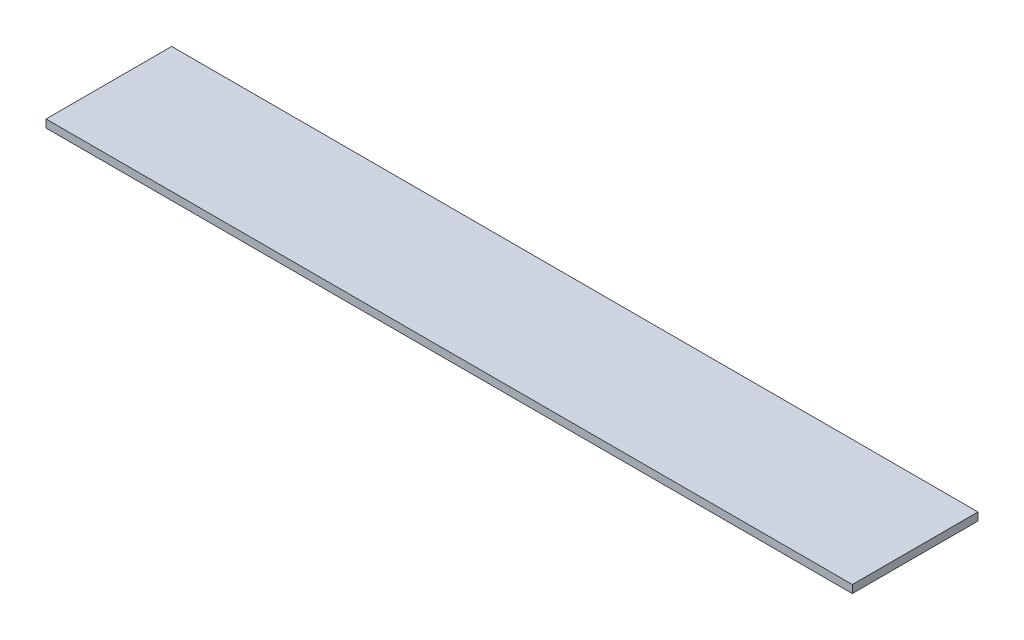
ISO-10303-21;
HEADER;
FILE_DESCRIPTION(('STEP AP214'),'2;1');
FILE_NAME('part.step','',(''),(''),'','','');
FILE_SCHEMA(('AUTOMOTIVE_DESIGN { 1 0 10303 214 1 1 1 1 }'));
ENDSEC;
DATA;
#1=APPLICATION_CONTEXT('core data for automotive mechanical design processes');
#2=APPLICATION_PROTOCOL_DEFINITION('international standard','automotive_design',2000,#1);
#3=PRODUCT_CONTEXT('',#1,'mechanical');
#4=PRODUCT('Part','Part','',(#3));
#5=PRODUCT_RELATED_PRODUCT_CATEGORY('part','',(#4));
#6=PRODUCT_DEFINITION_FORMATION('','',#4);
#7=PRODUCT_DEFINITION_CONTEXT('part definition',#1,'design');
#8=PRODUCT_DEFINITION('design','',#6,#7);
#9=PRODUCT_DEFINITION_SHAPE('','',#8);
#10=(LENGTH_UNIT() NAMED_UNIT(*) SI_UNIT(.MILLI.,.METRE.));
#11=(NAMED_UNIT(*) PLANE_ANGLE_UNIT() SI_UNIT($,.RADIAN.));
#12=(NAMED_UNIT(*) SI_UNIT($,.STERADIAN.) SOLID_ANGLE_UNIT());
#13=UNCERTAINTY_MEASURE_WITH_UNIT(LENGTH_MEASURE(1.E-05),#10,'distance_accuracy_value','');
#14=(GEOMETRIC_REPRESENTATION_CONTEXT(3) GLOBAL_UNCERTAINTY_ASSIGNED_CONTEXT((#13)) GLOBAL_UNIT_ASSIGNED_CONTEXT((#10,
#11,#12)) REPRESENTATION_CONTEXT('',''));
#15=CARTESIAN_POINT('',(0.,0.,0.));
#16=DIRECTION('',(0.,0.,1.));
#17=DIRECTION('',(1.,0.,0.));
#18=AXIS2_PLACEMENT_3D('',#15,#16,#17);
#19=CARTESIAN_POINT('',(0.,3.,0.));
#20=DIRECTION('',(1.,0.,0.));
#21=DIRECTION('',(0.,0.,-1.));
#22=AXIS2_PLACEMENT_3D('',#19,#20,#21);
#23=PLANE('',#22);
#24=DIRECTION('',(0.,0.,1.));
#25=VECTOR('',#24,1.);
#26=CARTESIAN_POINT('',(0.,0.,0.));
#27=LINE('',#26,#25);
#28=CARTESIAN_POINT('',(0.,0.,-48.));
#29=VERTEX_POINT('',#28);
#30=CARTESIAN_POINT('',(0.,0.,0.));
#31=VERTEX_POINT('',#30);
#32=EDGE_CURVE('E99',#29,#31,#27,.T.);
#33=ORIENTED_EDGE('',*,*,#32,.T.);
#34=DIRECTION('',(0.,-1.,0.));
#35=VECTOR('',#34,1.);
#36=CARTESIAN_POINT('',(0.,3.,0.));
#37=LINE('',#36,#35);
#38=CARTESIAN_POINT('',(0.,3.,0.));
#39=VERTEX_POINT('',#38);
#40=EDGE_CURVE('E11',#39,#31,#37,.T.);
#41=ORIENTED_EDGE('',*,*,#40,.F.);
#42=DIRECTION('',(0.,0.,1.));
#43=VECTOR('',#42,1.);
#44=CARTESIAN_POINT('',(0.,3.,0.));
#45=LINE('',#44,#43);
#46=CARTESIAN_POINT('',(0.,3.,-48.));
#47=VERTEX_POINT('',#46);
#48=EDGE_CURVE('E87',#47,#39,#45,.T.);
#49=ORIENTED_EDGE('',*,*,#48,.F.);
#50=DIRECTION('',(0.,-1.,0.));
#51=VECTOR('',#50,1.);
#52=CARTESIAN_POINT('',(0.,3.,-48.));
#53=LINE('',#52,#51);
#54=EDGE_CURVE('E95',#47,#29,#53,.T.);
#55=ORIENTED_EDGE('',*,*,#54,.T.);
#56=EDGE_LOOP('',(#33,#41,#49,#55));
#57=FACE_BOUND('',#56,.T.);
#58=ADVANCED_FACE('F36',(#57),#23,.F.);
#59=CARTESIAN_POINT('',(0.,3.,0.));
#60=DIRECTION('',(0.,0.,-1.));
#61=DIRECTION('',(-1.,0.,0.));
#62=AXIS2_PLACEMENT_3D('',#59,#60,#61);
#63=PLANE('',#62);
#64=DIRECTION('',(1.,0.,0.));
#65=VECTOR('',#64,1.);
#66=CARTESIAN_POINT('',(0.,0.,0.));
#67=LINE('',#66,#65);
#68=CARTESIAN_POINT('',(308.,0.,0.));
#69=VERTEX_POINT('',#68);
#70=EDGE_CURVE('E91',#31,#69,#67,.T.);
#71=ORIENTED_EDGE('',*,*,#70,.T.);
#72=DIRECTION('',(0.,-1.,0.));
#73=VECTOR('',#72,1.);
#74=CARTESIAN_POINT('',(308.,3.,0.));
#75=LINE('',#74,#73);
#76=CARTESIAN_POINT('',(308.,3.,0.));
#77=VERTEX_POINT('',#76);
#78=EDGE_CURVE('E44',#77,#69,#75,.T.);
#79=ORIENTED_EDGE('',*,*,#78,.F.);
#80=DIRECTION('',(1.,0.,0.));
#81=VECTOR('',#80,1.);
#82=CARTESIAN_POINT('',(0.,3.,0.));
#83=LINE('',#82,#81);
#84=EDGE_CURVE('E82',#39,#77,#83,.T.);
#85=ORIENTED_EDGE('',*,*,#84,.F.);
#86=ORIENTED_EDGE('',*,*,#40,.T.);
#87=EDGE_LOOP('',(#71,#79,#85,#86));
#88=FACE_BOUND('',#87,.T.);
#89=ADVANCED_FACE('F90',(#88),#63,.F.);
#90=CARTESIAN_POINT('',(308.,3.,0.));
#91=DIRECTION('',(-1.,0.,0.));
#92=DIRECTION('',(0.,0.,1.));
#93=AXIS2_PLACEMENT_3D('',#90,#91,#92);
#94=PLANE('',#93);
#95=DIRECTION('',(0.,0.,-1.));
#96=VECTOR('',#95,1.);
#97=CARTESIAN_POINT('',(308.,0.,0.));
#98=LINE('',#97,#96);
#99=CARTESIAN_POINT('',(308.,0.,-48.));
#100=VERTEX_POINT('',#99);
#101=EDGE_CURVE('E69',#69,#100,#98,.T.);
#102=ORIENTED_EDGE('',*,*,#101,.T.);
#103=DIRECTION('',(0.,-1.,0.));
#104=VECTOR('',#103,1.);
#105=CARTESIAN_POINT('',(308.,3.,-48.));
#106=LINE('',#105,#104);
#107=CARTESIAN_POINT('',(308.,3.,-48.));
#108=VERTEX_POINT('',#107);
#109=EDGE_CURVE('E92',#108,#100,#106,.T.);
#110=ORIENTED_EDGE('',*,*,#109,.F.);
#111=DIRECTION('',(0.,0.,-1.));
#112=VECTOR('',#111,1.);
#113=CARTESIAN_POINT('',(308.,3.,0.));
#114=LINE('',#113,#112);
#115=EDGE_CURVE('E85',#77,#108,#114,.T.);
#116=ORIENTED_EDGE('',*,*,#115,.F.);
#117=ORIENTED_EDGE('',*,*,#78,.T.);
#118=EDGE_LOOP('',(#102,#110,#116,#117));
#119=FACE_BOUND('',#118,.T.);
#120=ADVANCED_FACE('F93',(#119),#94,.F.);
#121=CARTESIAN_POINT('',(0.,3.,-48.));
#122=DIRECTION('',(0.,0.,1.));
#123=DIRECTION('',(1.,0.,0.));
#124=AXIS2_PLACEMENT_3D('',#121,#122,#123);
#125=PLANE('',#124);
#126=DIRECTION('',(-1.,0.,0.));
#127=VECTOR('',#126,1.);
#128=CARTESIAN_POINT('',(0.,0.,-48.));
#129=LINE('',#128,#127);
#130=EDGE_CURVE('E75',#100,#29,#129,.T.);
#131=ORIENTED_EDGE('',*,*,#130,.T.);
#132=ORIENTED_EDGE('',*,*,#54,.F.);
#133=DIRECTION('',(-1.,0.,0.));
#134=VECTOR('',#133,1.);
#135=CARTESIAN_POINT('',(0.,3.,-48.));
#136=LINE('',#135,#134);
#137=EDGE_CURVE('E52',#108,#47,#136,.T.);
#138=ORIENTED_EDGE('',*,*,#137,.F.);
#139=ORIENTED_EDGE('',*,*,#109,.T.);
#140=EDGE_LOOP('',(#131,#132,#138,#139));
#141=FACE_BOUND('',#140,.T.);
#142=ADVANCED_FACE('F106',(#141),#125,.F.);
#143=CARTESIAN_POINT('',(0.,3.,0.));
#144=DIRECTION('',(0.,-1.,0.));
#145=DIRECTION('',(0.,0.,-1.));
#146=AXIS2_PLACEMENT_3D('',#143,#144,#145);
#147=PLANE('',#146);
#148=ORIENTED_EDGE('',*,*,#48,.T.);
#149=ORIENTED_EDGE('',*,*,#84,.T.);
#150=ORIENTED_EDGE('',*,*,#115,.T.);
#151=ORIENTED_EDGE('',*,*,#137,.T.);
#152=EDGE_LOOP('',(#148,#149,#150,#151));
#153=FACE_BOUND('',#152,.T.);
#154=ADVANCED_FACE('F83',(#153),#147,.F.);
#155=CARTESIAN_POINT('',(0.,0.,0.));
#156=DIRECTION('',(0.,-1.,0.));
#157=DIRECTION('',(0.,0.,-1.));
#158=AXIS2_PLACEMENT_3D('',#155,#156,#157);
#159=PLANE('',#158);
#160=ORIENTED_EDGE('',*,*,#32,.F.);
#161=ORIENTED_EDGE('',*,*,#130,.F.);
#162=ORIENTED_EDGE('',*,*,#101,.F.);
#163=ORIENTED_EDGE('',*,*,#70,.F.);
#164=EDGE_LOOP('',(#160,#161,#162,#163));
#165=FACE_BOUND('',#164,.T.);
#166=ADVANCED_FACE('F109',(#165),#159,.T.);
#167=CLOSED_SHELL('',(#58,#89,#120,#142,#154,#166));
#168=MANIFOLD_SOLID_BREP('B2',#167);
#169=ADVANCED_BREP_SHAPE_REPRESENTATION('',(#18,#168),#14);
#170=SHAPE_DEFINITION_REPRESENTATION(#9,#169);
ENDSEC;
END-ISO-10303-21;
